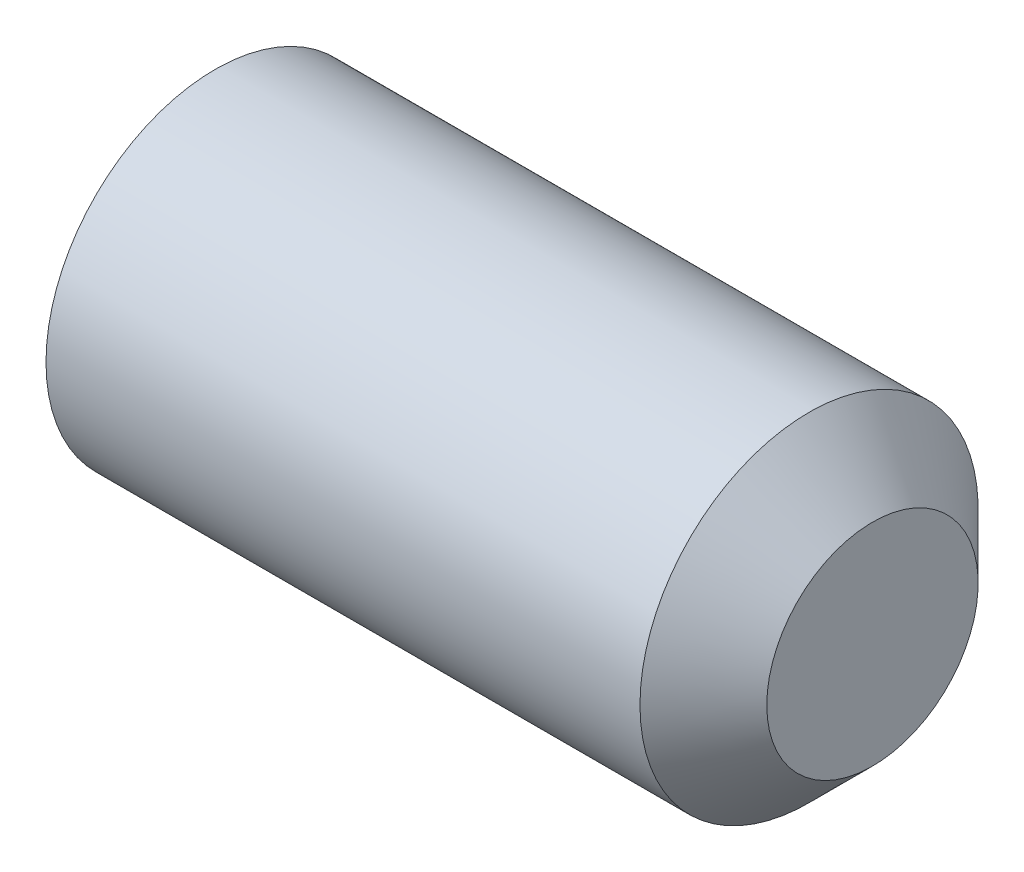
ISO-10303-21;
HEADER;
FILE_DESCRIPTION(('STEP AP214'),'2;1');
FILE_NAME('part.step','',(''),(''),'','','');
FILE_SCHEMA(('AUTOMOTIVE_DESIGN { 1 0 10303 214 1 1 1 1 }'));
ENDSEC;
DATA;
#1=APPLICATION_CONTEXT('core data for automotive mechanical design processes');
#2=APPLICATION_PROTOCOL_DEFINITION('international standard','automotive_design',2000,#1);
#3=PRODUCT_CONTEXT('',#1,'mechanical');
#4=PRODUCT('Part','Part','',(#3));
#5=PRODUCT_RELATED_PRODUCT_CATEGORY('part','',(#4));
#6=PRODUCT_DEFINITION_FORMATION('','',#4);
#7=PRODUCT_DEFINITION_CONTEXT('part definition',#1,'design');
#8=PRODUCT_DEFINITION('design','',#6,#7);
#9=PRODUCT_DEFINITION_SHAPE('','',#8);
#10=(LENGTH_UNIT() NAMED_UNIT(*) SI_UNIT(.MILLI.,.METRE.));
#11=(NAMED_UNIT(*) PLANE_ANGLE_UNIT() SI_UNIT($,.RADIAN.));
#12=(NAMED_UNIT(*) SI_UNIT($,.STERADIAN.) SOLID_ANGLE_UNIT());
#13=UNCERTAINTY_MEASURE_WITH_UNIT(LENGTH_MEASURE(1.E-05),#10,'distance_accuracy_value','');
#14=(GEOMETRIC_REPRESENTATION_CONTEXT(3) GLOBAL_UNCERTAINTY_ASSIGNED_CONTEXT((#13)) GLOBAL_UNIT_ASSIGNED_CONTEXT((#10,
#11,#12)) REPRESENTATION_CONTEXT('',''));
#15=CARTESIAN_POINT('',(0.,0.,0.));
#16=DIRECTION('',(0.,0.,1.));
#17=DIRECTION('',(1.,0.,0.));
#18=AXIS2_PLACEMENT_3D('',#15,#16,#17);
#19=CARTESIAN_POINT('',(0.,0.,0.));
#20=DIRECTION('',(-1.,0.,0.));
#21=DIRECTION('',(0.,0.,1.));
#22=AXIS2_PLACEMENT_3D('',#19,#20,#21);
#23=PLANE('',#22);
#24=CARTESIAN_POINT('',(0.,0.,0.));
#25=DIRECTION('',(-1.,0.,0.));
#26=DIRECTION('',(0.,0.,1.));
#27=AXIS2_PLACEMENT_3D('',#24,#25,#26);
#28=CIRCLE('',#27,1.61);
#29=CARTESIAN_POINT('',(0.,0.,1.61));
#30=VERTEX_POINT('',#29);
#31=EDGE_CURVE('E88',#30,#30,#28,.T.);
#32=ORIENTED_EDGE('',*,*,#31,.T.);
#33=EDGE_LOOP('',(#32));
#34=FACE_BOUND('',#33,.T.);
#35=DIRECTION('',(0.,0.,-1.));
#36=VECTOR('',#35,1.);
#37=CARTESIAN_POINT('',(0.,1.,0.577350269189624));
#38=LINE('',#37,#36);
#39=CARTESIAN_POINT('',(0.,1.,0.577350269189624));
#40=VERTEX_POINT('',#39);
#41=CARTESIAN_POINT('',(0.,1.,-0.577350269189628));
#42=VERTEX_POINT('',#41);
#43=EDGE_CURVE('E102',#40,#42,#38,.T.);
#44=ORIENTED_EDGE('',*,*,#43,.F.);
#45=DIRECTION('',(0.,-0.866025403784438,0.5));
#46=VECTOR('',#45,1.);
#47=CARTESIAN_POINT('',(0.,1.,0.577350269189624));
#48=LINE('',#47,#46);
#49=CARTESIAN_POINT('',(0.,0.,1.15470053837925));
#50=VERTEX_POINT('',#49);
#51=EDGE_CURVE('E47',#40,#50,#48,.T.);
#52=ORIENTED_EDGE('',*,*,#51,.T.);
#53=DIRECTION('',(0.,0.866025403784439,0.5));
#54=VECTOR('',#53,1.);
#55=CARTESIAN_POINT('',(0.,-0.999999999999997,0.577350269189624));
#56=LINE('',#55,#54);
#57=CARTESIAN_POINT('',(0.,-0.999999999999997,0.577350269189624));
#58=VERTEX_POINT('',#57);
#59=EDGE_CURVE('E92',#58,#50,#56,.T.);
#60=ORIENTED_EDGE('',*,*,#59,.F.);
#61=DIRECTION('',(0.,0.,-1.));
#62=VECTOR('',#61,1.);
#63=CARTESIAN_POINT('',(0.,-0.999999999999997,0.577350269189624));
#64=LINE('',#63,#62);
#65=CARTESIAN_POINT('',(0.,-0.999999999999997,-0.577350269189628));
#66=VERTEX_POINT('',#65);
#67=EDGE_CURVE('E97',#58,#66,#64,.T.);
#68=ORIENTED_EDGE('',*,*,#67,.T.);
#69=DIRECTION('',(0.,0.866025403784438,-0.500000000000001));
#70=VECTOR('',#69,1.);
#71=CARTESIAN_POINT('',(0.,-0.999999999999997,-0.577350269189628));
#72=LINE('',#71,#70);
#73=CARTESIAN_POINT('',(0.,0.,-1.15470053837925));
#74=VERTEX_POINT('',#73);
#75=EDGE_CURVE('E106',#66,#74,#72,.T.);
#76=ORIENTED_EDGE('',*,*,#75,.T.);
#77=DIRECTION('',(0.,-0.866025403784439,-0.5));
#78=VECTOR('',#77,1.);
#79=CARTESIAN_POINT('',(0.,1.,-0.577350269189628));
#80=LINE('',#79,#78);
#81=EDGE_CURVE('E109',#42,#74,#80,.T.);
#82=ORIENTED_EDGE('',*,*,#81,.F.);
#83=EDGE_LOOP('',(#44,#52,#60,#68,#76,#82));
#84=FACE_BOUND('',#83,.T.);
#85=ADVANCED_FACE('F32',(#34,#84),#23,.T.);
#86=CARTESIAN_POINT('',(8.,1.25,0.));
#87=DIRECTION('',(1.,0.,0.));
#88=DIRECTION('',(0.,0.,-1.));
#89=AXIS2_PLACEMENT_3D('',#86,#87,#88);
#90=PLANE('',#89);
#91=CARTESIAN_POINT('',(8.,0.,0.));
#92=DIRECTION('',(-1.,0.,0.));
#93=DIRECTION('',(0.,0.,1.));
#94=AXIS2_PLACEMENT_3D('',#91,#92,#93);
#95=CIRCLE('',#94,1.25);
#96=CARTESIAN_POINT('',(8.,0.,1.25));
#97=VERTEX_POINT('',#96);
#98=EDGE_CURVE('E11',#97,#97,#95,.T.);
#99=ORIENTED_EDGE('',*,*,#98,.F.);
#100=EDGE_LOOP('',(#99));
#101=FACE_BOUND('',#100,.T.);
#102=ADVANCED_FACE('F34',(#101),#90,.T.);
#103=CARTESIAN_POINT('',(7.25000000000006,0.,0.));
#104=DIRECTION('',(-1.,0.,0.));
#105=DIRECTION('',(0.,0.,1.));
#106=AXIS2_PLACEMENT_3D('',#103,#104,#105);
#107=CONICAL_SURFACE('',#106,2.,0.785398163397485);
#108=ORIENTED_EDGE('',*,*,#98,.T.);
#109=EDGE_LOOP('',(#108));
#110=FACE_BOUND('',#109,.T.);
#111=CARTESIAN_POINT('',(7.25000000000006,0.,0.));
#112=DIRECTION('',(-1.,0.,0.));
#113=DIRECTION('',(0.,0.,1.));
#114=AXIS2_PLACEMENT_3D('',#111,#112,#113);
#115=CIRCLE('',#114,2.);
#116=CARTESIAN_POINT('',(7.25000000000006,0.,2.));
#117=VERTEX_POINT('',#116);
#118=EDGE_CURVE('E40',#117,#117,#115,.T.);
#119=ORIENTED_EDGE('',*,*,#118,.F.);
#120=EDGE_LOOP('',(#119));
#121=FACE_BOUND('',#120,.T.);
#122=ADVANCED_FACE('F144',(#110,#121),#107,.T.);
#123=CARTESIAN_POINT('',(-12.7,0.,0.));
#124=DIRECTION('',(-1.,0.,0.));
#125=DIRECTION('',(0.,0.,1.));
#126=AXIS2_PLACEMENT_3D('',#123,#124,#125);
#127=CYLINDRICAL_SURFACE('',#126,2.);
#128=ORIENTED_EDGE('',*,*,#118,.T.);
#129=EDGE_LOOP('',(#128));
#130=FACE_BOUND('',#129,.T.);
#131=CARTESIAN_POINT('',(0.225166604983952,0.,0.));
#132=DIRECTION('',(-1.,0.,0.));
#133=DIRECTION('',(0.,0.,1.));
#134=AXIS2_PLACEMENT_3D('',#131,#132,#133);
#135=CIRCLE('',#134,2.);
#136=CARTESIAN_POINT('',(0.225166604983952,0.,2.));
#137=VERTEX_POINT('',#136);
#138=EDGE_CURVE('E136',#137,#137,#135,.T.);
#139=ORIENTED_EDGE('',*,*,#138,.F.);
#140=EDGE_LOOP('',(#139));
#141=FACE_BOUND('',#140,.T.);
#142=ADVANCED_FACE('F141',(#130,#141),#127,.T.);
#143=CARTESIAN_POINT('',(0.,0.,0.));
#144=DIRECTION('',(1.,0.,0.));
#145=DIRECTION('',(0.,0.,-1.));
#146=AXIS2_PLACEMENT_3D('',#143,#144,#145);
#147=CONICAL_SURFACE('',#146,1.61,1.0471975511966);
#148=ORIENTED_EDGE('',*,*,#138,.T.);
#149=EDGE_LOOP('',(#148));
#150=FACE_BOUND('',#149,.T.);
#151=ORIENTED_EDGE('',*,*,#31,.F.);
#152=EDGE_LOOP('',(#151));
#153=FACE_BOUND('',#152,.T.);
#154=ADVANCED_FACE('F151',(#150,#153),#147,.T.);
#155=CARTESIAN_POINT('',(2.5,1.,0.577350269189624));
#156=DIRECTION('',(0.,-0.5,-0.866025403784438));
#157=DIRECTION('',(0.,0.866025403784438,-0.5));
#158=AXIS2_PLACEMENT_3D('',#155,#156,#157);
#159=PLANE('',#158);
#160=ORIENTED_EDGE('',*,*,#51,.F.);
#161=DIRECTION('',(-1.,0.,0.));
#162=VECTOR('',#161,1.);
#163=CARTESIAN_POINT('',(2.5,1.,0.577350269189624));
#164=LINE('',#163,#162);
#165=CARTESIAN_POINT('',(2.5,1.,0.577350269189624));
#166=VERTEX_POINT('',#165);
#167=EDGE_CURVE('E51',#166,#40,#164,.T.);
#168=ORIENTED_EDGE('',*,*,#167,.F.);
#169=DIRECTION('',(0.,-0.866025403784438,0.5));
#170=VECTOR('',#169,1.);
#171=CARTESIAN_POINT('',(2.5,1.,0.577350269189624));
#172=LINE('',#171,#170);
#173=CARTESIAN_POINT('',(2.5,0.,1.15470053837925));
#174=VERTEX_POINT('',#173);
#175=EDGE_CURVE('E84',#166,#174,#172,.T.);
#176=ORIENTED_EDGE('',*,*,#175,.T.);
#177=DIRECTION('',(-1.,0.,0.));
#178=VECTOR('',#177,1.);
#179=CARTESIAN_POINT('',(2.5,0.,1.15470053837925));
#180=LINE('',#179,#178);
#181=EDGE_CURVE('E81',#174,#50,#180,.T.);
#182=ORIENTED_EDGE('',*,*,#181,.T.);
#183=EDGE_LOOP('',(#160,#168,#176,#182));
#184=FACE_BOUND('',#183,.T.);
#185=ADVANCED_FACE('F83',(#184),#159,.T.);
#186=CARTESIAN_POINT('',(2.5,-0.999999999999997,0.577350269189624));
#187=DIRECTION('',(0.,-0.5,0.866025403784439));
#188=DIRECTION('',(0.,-0.866025403784439,-0.5));
#189=AXIS2_PLACEMENT_3D('',#186,#187,#188);
#190=PLANE('',#189);
#191=ORIENTED_EDGE('',*,*,#59,.T.);
#192=ORIENTED_EDGE('',*,*,#181,.F.);
#193=DIRECTION('',(0.,0.866025403784439,0.5));
#194=VECTOR('',#193,1.);
#195=CARTESIAN_POINT('',(2.5,-0.999999999999997,0.577350269189624));
#196=LINE('',#195,#194);
#197=CARTESIAN_POINT('',(2.5,-0.999999999999997,0.577350269189624));
#198=VERTEX_POINT('',#197);
#199=EDGE_CURVE('E114',#198,#174,#196,.T.);
#200=ORIENTED_EDGE('',*,*,#199,.F.);
#201=DIRECTION('',(-1.,0.,0.));
#202=VECTOR('',#201,1.);
#203=CARTESIAN_POINT('',(2.5,-0.999999999999997,0.577350269189624));
#204=LINE('',#203,#202);
#205=EDGE_CURVE('E89',#198,#58,#204,.T.);
#206=ORIENTED_EDGE('',*,*,#205,.T.);
#207=EDGE_LOOP('',(#191,#192,#200,#206));
#208=FACE_BOUND('',#207,.T.);
#209=ADVANCED_FACE('F93',(#208),#190,.F.);
#210=CARTESIAN_POINT('',(2.5,-0.999999999999997,0.577350269189624));
#211=DIRECTION('',(0.,1.,0.));
#212=DIRECTION('',(0.,0.,1.));
#213=AXIS2_PLACEMENT_3D('',#210,#211,#212);
#214=PLANE('',#213);
#215=ORIENTED_EDGE('',*,*,#67,.F.);
#216=ORIENTED_EDGE('',*,*,#205,.F.);
#217=DIRECTION('',(0.,0.,-1.));
#218=VECTOR('',#217,1.);
#219=CARTESIAN_POINT('',(2.5,-0.999999999999997,0.577350269189624));
#220=LINE('',#219,#218);
#221=CARTESIAN_POINT('',(2.5,-0.999999999999997,-0.577350269189628));
#222=VERTEX_POINT('',#221);
#223=EDGE_CURVE('E116',#198,#222,#220,.T.);
#224=ORIENTED_EDGE('',*,*,#223,.T.);
#225=DIRECTION('',(-1.,0.,0.));
#226=VECTOR('',#225,1.);
#227=CARTESIAN_POINT('',(2.5,-0.999999999999997,-0.577350269189628));
#228=LINE('',#227,#226);
#229=EDGE_CURVE('E131',#222,#66,#228,.T.);
#230=ORIENTED_EDGE('',*,*,#229,.T.);
#231=EDGE_LOOP('',(#215,#216,#224,#230));
#232=FACE_BOUND('',#231,.T.);
#233=ADVANCED_FACE('F173',(#232),#214,.T.);
#234=CARTESIAN_POINT('',(2.5,-0.999999999999997,-0.577350269189628));
#235=DIRECTION('',(0.,0.500000000000001,0.866025403784438));
#236=DIRECTION('',(0.,-0.866025403784438,0.500000000000001));
#237=AXIS2_PLACEMENT_3D('',#234,#235,#236);
#238=PLANE('',#237);
#239=ORIENTED_EDGE('',*,*,#75,.F.);
#240=ORIENTED_EDGE('',*,*,#229,.F.);
#241=DIRECTION('',(0.,0.866025403784438,-0.500000000000001));
#242=VECTOR('',#241,1.);
#243=CARTESIAN_POINT('',(2.5,-0.999999999999997,-0.577350269189628));
#244=LINE('',#243,#242);
#245=CARTESIAN_POINT('',(2.5,0.,-1.15470053837925));
#246=VERTEX_POINT('',#245);
#247=EDGE_CURVE('E118',#222,#246,#244,.T.);
#248=ORIENTED_EDGE('',*,*,#247,.T.);
#249=DIRECTION('',(-1.,0.,0.));
#250=VECTOR('',#249,1.);
#251=CARTESIAN_POINT('',(2.5,0.,-1.15470053837925));
#252=LINE('',#251,#250);
#253=EDGE_CURVE('E129',#246,#74,#252,.T.);
#254=ORIENTED_EDGE('',*,*,#253,.T.);
#255=EDGE_LOOP('',(#239,#240,#248,#254));
#256=FACE_BOUND('',#255,.T.);
#257=ADVANCED_FACE('F177',(#256),#238,.T.);
#258=CARTESIAN_POINT('',(2.5,1.,-0.577350269189628));
#259=DIRECTION('',(0.,0.5,-0.866025403784439));
#260=DIRECTION('',(0.,0.866025403784439,0.5));
#261=AXIS2_PLACEMENT_3D('',#258,#259,#260);
#262=PLANE('',#261);
#263=ORIENTED_EDGE('',*,*,#81,.T.);
#264=ORIENTED_EDGE('',*,*,#253,.F.);
#265=DIRECTION('',(0.,-0.866025403784439,-0.5));
#266=VECTOR('',#265,1.);
#267=CARTESIAN_POINT('',(2.5,1.,-0.577350269189628));
#268=LINE('',#267,#266);
#269=CARTESIAN_POINT('',(2.5,1.,-0.577350269189628));
#270=VERTEX_POINT('',#269);
#271=EDGE_CURVE('E120',#270,#246,#268,.T.);
#272=ORIENTED_EDGE('',*,*,#271,.F.);
#273=DIRECTION('',(-1.,0.,0.));
#274=VECTOR('',#273,1.);
#275=CARTESIAN_POINT('',(2.5,1.,-0.577350269189628));
#276=LINE('',#275,#274);
#277=EDGE_CURVE('E127',#270,#42,#276,.T.);
#278=ORIENTED_EDGE('',*,*,#277,.T.);
#279=EDGE_LOOP('',(#263,#264,#272,#278));
#280=FACE_BOUND('',#279,.T.);
#281=ADVANCED_FACE('F183',(#280),#262,.F.);
#282=CARTESIAN_POINT('',(2.5,1.,0.577350269189624));
#283=DIRECTION('',(0.,1.,0.));
#284=DIRECTION('',(0.,0.,1.));
#285=AXIS2_PLACEMENT_3D('',#282,#283,#284);
#286=PLANE('',#285);
#287=ORIENTED_EDGE('',*,*,#43,.T.);
#288=ORIENTED_EDGE('',*,*,#277,.F.);
#289=DIRECTION('',(0.,0.,-1.));
#290=VECTOR('',#289,1.);
#291=CARTESIAN_POINT('',(2.5,1.,0.577350269189624));
#292=LINE('',#291,#290);
#293=EDGE_CURVE('E123',#166,#270,#292,.T.);
#294=ORIENTED_EDGE('',*,*,#293,.F.);
#295=ORIENTED_EDGE('',*,*,#167,.T.);
#296=EDGE_LOOP('',(#287,#288,#294,#295));
#297=FACE_BOUND('',#296,.T.);
#298=ADVANCED_FACE('F187',(#297),#286,.F.);
#299=CARTESIAN_POINT('',(2.5,0.,1.15470053837925));
#300=DIRECTION('',(-1.,0.,0.));
#301=DIRECTION('',(0.,0.,1.));
#302=AXIS2_PLACEMENT_3D('',#299,#300,#301);
#303=PLANE('',#302);
#304=ORIENTED_EDGE('',*,*,#175,.F.);
#305=ORIENTED_EDGE('',*,*,#293,.T.);
#306=ORIENTED_EDGE('',*,*,#271,.T.);
#307=ORIENTED_EDGE('',*,*,#247,.F.);
#308=ORIENTED_EDGE('',*,*,#223,.F.);
#309=ORIENTED_EDGE('',*,*,#199,.T.);
#310=EDGE_LOOP('',(#304,#305,#306,#307,#308,#309));
#311=FACE_BOUND('',#310,.T.);
#312=ADVANCED_FACE('F191',(#311),#303,.T.);
#313=CLOSED_SHELL('',(#85,#102,#122,#142,#154,#185,#209,#233,#257,#281,#298,#312));
#314=MANIFOLD_SOLID_BREP('B2',#313);
#315=ADVANCED_BREP_SHAPE_REPRESENTATION('',(#18,#314),#14);
#316=SHAPE_DEFINITION_REPRESENTATION(#9,#315);
ENDSEC;
END-ISO-10303-21;
